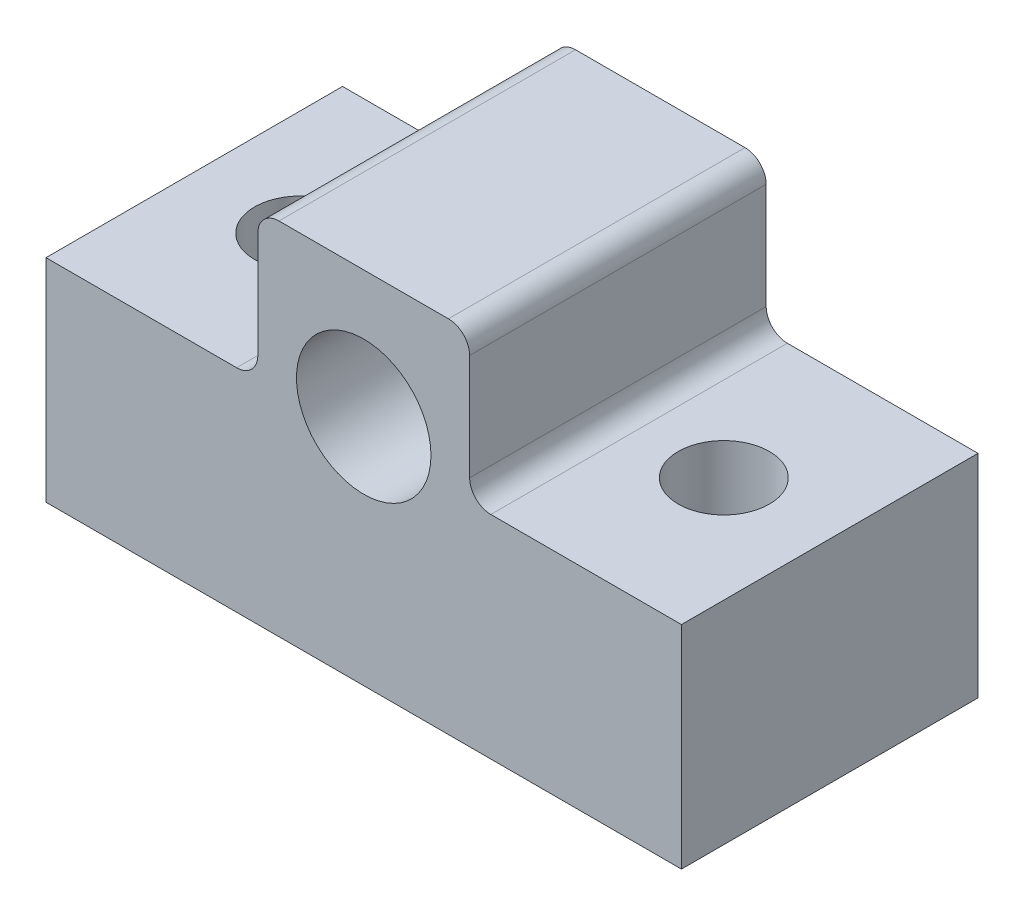
ISO-10303-21;
HEADER;
FILE_DESCRIPTION(('STEP AP214'),'2;1');
FILE_NAME('part.step','',(''),(''),'','','');
FILE_SCHEMA(('AUTOMOTIVE_DESIGN { 1 0 10303 214 1 1 1 1 }'));
ENDSEC;
DATA;
#1=APPLICATION_CONTEXT('core data for automotive mechanical design processes');
#2=APPLICATION_PROTOCOL_DEFINITION('international standard','automotive_design',2000,#1);
#3=PRODUCT_CONTEXT('',#1,'mechanical');
#4=PRODUCT('Part','Part','',(#3));
#5=PRODUCT_RELATED_PRODUCT_CATEGORY('part','',(#4));
#6=PRODUCT_DEFINITION_FORMATION('','',#4);
#7=PRODUCT_DEFINITION_CONTEXT('part definition',#1,'design');
#8=PRODUCT_DEFINITION('design','',#6,#7);
#9=PRODUCT_DEFINITION_SHAPE('','',#8);
#10=(LENGTH_UNIT() NAMED_UNIT(*) SI_UNIT(.MILLI.,.METRE.));
#11=(NAMED_UNIT(*) PLANE_ANGLE_UNIT() SI_UNIT($,.RADIAN.));
#12=(NAMED_UNIT(*) SI_UNIT($,.STERADIAN.) SOLID_ANGLE_UNIT());
#13=UNCERTAINTY_MEASURE_WITH_UNIT(LENGTH_MEASURE(1.E-05),#10,'distance_accuracy_value','');
#14=(GEOMETRIC_REPRESENTATION_CONTEXT(3) GLOBAL_UNCERTAINTY_ASSIGNED_CONTEXT((#13)) GLOBAL_UNIT_ASSIGNED_CONTEXT((#10,
#11,#12)) REPRESENTATION_CONTEXT('',''));
#15=CARTESIAN_POINT('',(0.,0.,0.));
#16=DIRECTION('',(0.,0.,1.));
#17=DIRECTION('',(1.,0.,0.));
#18=AXIS2_PLACEMENT_3D('',#15,#16,#17);
#19=CARTESIAN_POINT('',(-15.,-26.,6.99999999999993));
#20=DIRECTION('',(1.,0.,0.));
#21=DIRECTION('',(0.,0.,-1.));
#22=AXIS2_PLACEMENT_3D('',#19,#20,#21);
#23=PLANE('',#22);
#24=DIRECTION('',(0.,0.,1.));
#25=VECTOR('',#24,1.);
#26=CARTESIAN_POINT('',(-15.,-16.,-7.00000000000005));
#27=LINE('',#26,#25);
#28=CARTESIAN_POINT('',(-15.,-16.,-7.00000000000005));
#29=VERTEX_POINT('',#28);
#30=CARTESIAN_POINT('',(-15.,-16.,6.99999999999995));
#31=VERTEX_POINT('',#30);
#32=EDGE_CURVE('E173',#29,#31,#27,.T.);
#33=ORIENTED_EDGE('',*,*,#32,.F.);
#34=DIRECTION('',(0.,-1.,0.));
#35=VECTOR('',#34,1.);
#36=CARTESIAN_POINT('',(-15.,-26.,-7.00000000000007));
#37=LINE('',#36,#35);
#38=CARTESIAN_POINT('',(-15.,-26.,-7.00000000000007));
#39=VERTEX_POINT('',#38);
#40=EDGE_CURVE('E153',#29,#39,#37,.T.);
#41=ORIENTED_EDGE('',*,*,#40,.T.);
#42=DIRECTION('',(0.,0.,-1.));
#43=VECTOR('',#42,1.);
#44=CARTESIAN_POINT('',(-15.,-26.,6.99999999999993));
#45=LINE('',#44,#43);
#46=CARTESIAN_POINT('',(-15.,-26.,6.99999999999993));
#47=VERTEX_POINT('',#46);
#48=EDGE_CURVE('E161',#47,#39,#45,.T.);
#49=ORIENTED_EDGE('',*,*,#48,.F.);
#50=DIRECTION('',(0.,-1.,0.));
#51=VECTOR('',#50,1.);
#52=CARTESIAN_POINT('',(-15.,-26.,6.99999999999993));
#53=LINE('',#52,#51);
#54=EDGE_CURVE('E148',#31,#47,#53,.T.);
#55=ORIENTED_EDGE('',*,*,#54,.F.);
#56=EDGE_LOOP('',(#33,#41,#49,#55));
#57=FACE_BOUND('',#56,.T.);
#58=ADVANCED_FACE('F32',(#57),#23,.F.);
#59=CARTESIAN_POINT('',(-9.99999999999999,-9.00000000000001,0.));
#60=DIRECTION('',(0.,1.,0.));
#61=DIRECTION('',(0.,0.,1.));
#62=AXIS2_PLACEMENT_3D('',#59,#60,#61);
#63=CYLINDRICAL_SURFACE('',#62,2.15264999999999);
#64=CARTESIAN_POINT('',(-9.99999999999999,-26.,0.));
#65=DIRECTION('',(0.,1.,0.));
#66=DIRECTION('',(0.,0.,1.));
#67=AXIS2_PLACEMENT_3D('',#64,#65,#66);
#68=CIRCLE('',#67,2.15264999999999);
#69=CARTESIAN_POINT('',(-9.99999999999999,-26.,2.15264999999992));
#70=VERTEX_POINT('',#69);
#71=EDGE_CURVE('E257',#70,#70,#68,.T.);
#72=ORIENTED_EDGE('',*,*,#71,.F.);
#73=EDGE_LOOP('',(#72));
#74=FACE_BOUND('',#73,.T.);
#75=CARTESIAN_POINT('',(-9.99999999999999,-16.,0.));
#76=DIRECTION('',(0.,1.,0.));
#77=DIRECTION('',(0.,0.,1.));
#78=AXIS2_PLACEMENT_3D('',#75,#76,#77);
#79=CIRCLE('',#78,2.15264999999999);
#80=CARTESIAN_POINT('',(-9.99999999999999,-16.,2.15264999999992));
#81=VERTEX_POINT('',#80);
#82=EDGE_CURVE('E165',#81,#81,#79,.F.);
#83=ORIENTED_EDGE('',*,*,#82,.F.);
#84=EDGE_LOOP('',(#83));
#85=FACE_BOUND('',#84,.T.);
#86=ADVANCED_FACE('F227',(#74,#85),#63,.F.);
#87=CARTESIAN_POINT('',(15.,-26.,6.99999999999993));
#88=DIRECTION('',(0.,1.,0.));
#89=DIRECTION('',(0.,0.,1.));
#90=AXIS2_PLACEMENT_3D('',#87,#88,#89);
#91=PLANE('',#90);
#92=CARTESIAN_POINT('',(9.99999999999999,-26.,0.));
#93=DIRECTION('',(0.,1.,0.));
#94=DIRECTION('',(0.,0.,1.));
#95=AXIS2_PLACEMENT_3D('',#92,#93,#94);
#96=CIRCLE('',#95,2.15264999999999);
#97=CARTESIAN_POINT('',(9.99999999999999,-26.,2.15264999999992));
#98=VERTEX_POINT('',#97);
#99=EDGE_CURVE('E168',#98,#98,#96,.T.);
#100=ORIENTED_EDGE('',*,*,#99,.T.);
#101=EDGE_LOOP('',(#100));
#102=FACE_BOUND('',#101,.T.);
#103=ORIENTED_EDGE('',*,*,#71,.T.);
#104=EDGE_LOOP('',(#103));
#105=FACE_BOUND('',#104,.T.);
#106=DIRECTION('',(1.,0.,0.));
#107=VECTOR('',#106,1.);
#108=CARTESIAN_POINT('',(15.,-26.,-7.00000000000007));
#109=LINE('',#108,#107);
#110=CARTESIAN_POINT('',(15.,-26.,-7.00000000000007));
#111=VERTEX_POINT('',#110);
#112=EDGE_CURVE('E149',#39,#111,#109,.T.);
#113=ORIENTED_EDGE('',*,*,#112,.T.);
#114=DIRECTION('',(0.,0.,-1.));
#115=VECTOR('',#114,1.);
#116=CARTESIAN_POINT('',(15.,-26.,6.99999999999993));
#117=LINE('',#116,#115);
#118=CARTESIAN_POINT('',(15.,-26.,6.99999999999993));
#119=VERTEX_POINT('',#118);
#120=EDGE_CURVE('E147',#119,#111,#117,.T.);
#121=ORIENTED_EDGE('',*,*,#120,.F.);
#122=DIRECTION('',(1.,0.,0.));
#123=VECTOR('',#122,1.);
#124=CARTESIAN_POINT('',(15.,-26.,6.99999999999993));
#125=LINE('',#124,#123);
#126=EDGE_CURVE('E151',#47,#119,#125,.T.);
#127=ORIENTED_EDGE('',*,*,#126,.F.);
#128=ORIENTED_EDGE('',*,*,#48,.T.);
#129=EDGE_LOOP('',(#113,#121,#127,#128));
#130=FACE_BOUND('',#129,.T.);
#131=ADVANCED_FACE('F232',(#102,#105,#130),#91,.F.);
#132=CARTESIAN_POINT('',(15.,-26.,6.99999999999993));
#133=DIRECTION('',(-1.,0.,0.));
#134=DIRECTION('',(0.,0.,1.));
#135=AXIS2_PLACEMENT_3D('',#132,#133,#134);
#136=PLANE('',#135);
#137=DIRECTION('',(0.,1.,0.));
#138=VECTOR('',#137,1.);
#139=CARTESIAN_POINT('',(15.,-26.,-7.00000000000007));
#140=LINE('',#139,#138);
#141=CARTESIAN_POINT('',(15.,-16.,-7.00000000000005));
#142=VERTEX_POINT('',#141);
#143=EDGE_CURVE('E139',#111,#142,#140,.T.);
#144=ORIENTED_EDGE('',*,*,#143,.T.);
#145=DIRECTION('',(0.,0.,-1.));
#146=VECTOR('',#145,1.);
#147=CARTESIAN_POINT('',(15.,-16.,-7.00000000000005));
#148=LINE('',#147,#146);
#149=CARTESIAN_POINT('',(15.,-16.,6.99999999999995));
#150=VERTEX_POINT('',#149);
#151=EDGE_CURVE('E120',#150,#142,#148,.T.);
#152=ORIENTED_EDGE('',*,*,#151,.F.);
#153=DIRECTION('',(0.,1.,0.));
#154=VECTOR('',#153,1.);
#155=CARTESIAN_POINT('',(15.,-26.,6.99999999999993));
#156=LINE('',#155,#154);
#157=EDGE_CURVE('E158',#119,#150,#156,.T.);
#158=ORIENTED_EDGE('',*,*,#157,.F.);
#159=ORIENTED_EDGE('',*,*,#120,.T.);
#160=EDGE_LOOP('',(#144,#152,#158,#159));
#161=FACE_BOUND('',#160,.T.);
#162=ADVANCED_FACE('F145',(#161),#136,.F.);
#163=CARTESIAN_POINT('',(-15.,26.,7.00000000000007));
#164=DIRECTION('',(0.,0.,-1.));
#165=DIRECTION('',(-1.,0.,0.));
#166=AXIS2_PLACEMENT_3D('',#163,#164,#165);
#167=PLANE('',#166);
#168=CARTESIAN_POINT('',(0.,-15.,6.99999999999995));
#169=DIRECTION('',(0.,0.,1.));
#170=DIRECTION('',(1.,0.,0.));
#171=AXIS2_PLACEMENT_3D('',#168,#169,#170);
#172=CIRCLE('',#171,3.175);
#173=CARTESIAN_POINT('',(3.175,-15.,6.99999999999995));
#174=VERTEX_POINT('',#173);
#175=EDGE_CURVE('E254',#174,#174,#172,.T.);
#176=ORIENTED_EDGE('',*,*,#175,.F.);
#177=EDGE_LOOP('',(#176));
#178=FACE_BOUND('',#177,.T.);
#179=DIRECTION('',(0.,1.,0.));
#180=VECTOR('',#179,1.);
#181=CARTESIAN_POINT('',(5.,-16.,6.99999999999995));
#182=LINE('',#181,#180);
#183=CARTESIAN_POINT('',(5.,-15.,6.99999999999995));
#184=VERTEX_POINT('',#183);
#185=CARTESIAN_POINT('',(5.,-9.99999999999998,7.));
#186=VERTEX_POINT('',#185);
#187=EDGE_CURVE('E174',#184,#186,#182,.T.);
#188=ORIENTED_EDGE('',*,*,#187,.T.);
#189=CARTESIAN_POINT('',(4.,-9.99999999999998,7.));
#190=DIRECTION('',(0.,0.,-1.));
#191=DIRECTION('',(-1.,0.,0.));
#192=AXIS2_PLACEMENT_3D('',#189,#190,#191);
#193=CIRCLE('',#192,1.);
#194=CARTESIAN_POINT('',(3.99999999999999,-8.99999999999998,7.));
#195=VERTEX_POINT('',#194);
#196=EDGE_CURVE('E183',#186,#195,#193,.F.);
#197=ORIENTED_EDGE('',*,*,#196,.T.);
#198=DIRECTION('',(1.,0.,0.));
#199=VECTOR('',#198,1.);
#200=CARTESIAN_POINT('',(-15.,-8.99999999999998,7.));
#201=LINE('',#200,#199);
#202=CARTESIAN_POINT('',(-4.,-8.99999999999998,7.));
#203=VERTEX_POINT('',#202);
#204=EDGE_CURVE('E246',#203,#195,#201,.T.);
#205=ORIENTED_EDGE('',*,*,#204,.F.);
#206=CARTESIAN_POINT('',(-4.,-9.99999999999998,7.));
#207=DIRECTION('',(0.,0.,-1.));
#208=DIRECTION('',(-1.,0.,0.));
#209=AXIS2_PLACEMENT_3D('',#206,#207,#208);
#210=CIRCLE('',#209,1.);
#211=CARTESIAN_POINT('',(-5.,-9.99999999999998,7.));
#212=VERTEX_POINT('',#211);
#213=EDGE_CURVE('E181',#203,#212,#210,.F.);
#214=ORIENTED_EDGE('',*,*,#213,.T.);
#215=DIRECTION('',(0.,1.,0.));
#216=VECTOR('',#215,1.);
#217=CARTESIAN_POINT('',(-5.,-16.,6.99999999999995));
#218=LINE('',#217,#216);
#219=CARTESIAN_POINT('',(-5.,-15.,6.99999999999995));
#220=VERTEX_POINT('',#219);
#221=EDGE_CURVE('E262',#220,#212,#218,.T.);
#222=ORIENTED_EDGE('',*,*,#221,.F.);
#223=CARTESIAN_POINT('',(-6.00000000000001,-15.,6.99999999999995));
#224=DIRECTION('',(0.,0.,-1.));
#225=DIRECTION('',(-1.,0.,0.));
#226=AXIS2_PLACEMENT_3D('',#223,#224,#225);
#227=CIRCLE('',#226,1.);
#228=CARTESIAN_POINT('',(-6.00000000000001,-16.,6.99999999999995));
#229=VERTEX_POINT('',#228);
#230=EDGE_CURVE('E11',#220,#229,#227,.T.);
#231=ORIENTED_EDGE('',*,*,#230,.T.);
#232=DIRECTION('',(1.,0.,0.));
#233=VECTOR('',#232,1.);
#234=CARTESIAN_POINT('',(-15.,-16.,6.99999999999995));
#235=LINE('',#234,#233);
#236=EDGE_CURVE('E242',#31,#229,#235,.T.);
#237=ORIENTED_EDGE('',*,*,#236,.F.);
#238=ORIENTED_EDGE('',*,*,#54,.T.);
#239=ORIENTED_EDGE('',*,*,#126,.T.);
#240=ORIENTED_EDGE('',*,*,#157,.T.);
#241=DIRECTION('',(1.,0.,0.));
#242=VECTOR('',#241,1.);
#243=CARTESIAN_POINT('',(15.,-16.,6.99999999999995));
#244=LINE('',#243,#242);
#245=CARTESIAN_POINT('',(6.00000000000001,-16.,6.99999999999995));
#246=VERTEX_POINT('',#245);
#247=EDGE_CURVE('E128',#246,#150,#244,.T.);
#248=ORIENTED_EDGE('',*,*,#247,.F.);
#249=CARTESIAN_POINT('',(6.00000000000001,-15.,6.99999999999995));
#250=DIRECTION('',(0.,0.,-1.));
#251=DIRECTION('',(-1.,0.,0.));
#252=AXIS2_PLACEMENT_3D('',#249,#250,#251);
#253=CIRCLE('',#252,1.);
#254=EDGE_CURVE('E199',#246,#184,#253,.T.);
#255=ORIENTED_EDGE('',*,*,#254,.T.);
#256=EDGE_LOOP('',(#188,#197,#205,#214,#222,#231,#237,#238,#239,#240,#248,#255));
#257=FACE_BOUND('',#256,.T.);
#258=ADVANCED_FACE('F204',(#178,#257),#167,.F.);
#259=CARTESIAN_POINT('',(-15.,25.9999999999999,-6.99999999999993));
#260=DIRECTION('',(0.,0.,-1.));
#261=DIRECTION('',(-1.,0.,0.));
#262=AXIS2_PLACEMENT_3D('',#259,#260,#261);
#263=PLANE('',#262);
#264=DIRECTION('',(1.,0.,0.));
#265=VECTOR('',#264,1.);
#266=CARTESIAN_POINT('',(-15.,-9.00000000000001,-7.));
#267=LINE('',#266,#265);
#268=CARTESIAN_POINT('',(-4.,-9.00000000000001,-7.));
#269=VERTEX_POINT('',#268);
#270=CARTESIAN_POINT('',(3.99999999999999,-9.00000000000001,-7.));
#271=VERTEX_POINT('',#270);
#272=EDGE_CURVE('E245',#269,#271,#267,.T.);
#273=ORIENTED_EDGE('',*,*,#272,.T.);
#274=CARTESIAN_POINT('',(4.,-10.,-7.));
#275=DIRECTION('',(0.,0.,-1.));
#276=DIRECTION('',(-1.,0.,0.));
#277=AXIS2_PLACEMENT_3D('',#274,#275,#276);
#278=CIRCLE('',#277,1.);
#279=CARTESIAN_POINT('',(5.,-10.,-7.00000000000001));
#280=VERTEX_POINT('',#279);
#281=EDGE_CURVE('E190',#271,#280,#278,.T.);
#282=ORIENTED_EDGE('',*,*,#281,.T.);
#283=DIRECTION('',(0.,1.,0.));
#284=VECTOR('',#283,1.);
#285=CARTESIAN_POINT('',(5.,-16.,-7.00000000000005));
#286=LINE('',#285,#284);
#287=CARTESIAN_POINT('',(5.,-15.,-7.00000000000005));
#288=VERTEX_POINT('',#287);
#289=EDGE_CURVE('E211',#288,#280,#286,.T.);
#290=ORIENTED_EDGE('',*,*,#289,.F.);
#291=CARTESIAN_POINT('',(6.00000000000001,-15.,-7.00000000000005));
#292=DIRECTION('',(0.,0.,-1.));
#293=DIRECTION('',(-1.,0.,0.));
#294=AXIS2_PLACEMENT_3D('',#291,#292,#293);
#295=CIRCLE('',#294,1.);
#296=CARTESIAN_POINT('',(6.00000000000001,-16.,-7.00000000000005));
#297=VERTEX_POINT('',#296);
#298=EDGE_CURVE('E142',#288,#297,#295,.F.);
#299=ORIENTED_EDGE('',*,*,#298,.T.);
#300=DIRECTION('',(-1.,0.,0.));
#301=VECTOR('',#300,1.);
#302=CARTESIAN_POINT('',(15.,-16.,-7.00000000000005));
#303=LINE('',#302,#301);
#304=EDGE_CURVE('E125',#142,#297,#303,.T.);
#305=ORIENTED_EDGE('',*,*,#304,.F.);
#306=ORIENTED_EDGE('',*,*,#143,.F.);
#307=ORIENTED_EDGE('',*,*,#112,.F.);
#308=ORIENTED_EDGE('',*,*,#40,.F.);
#309=DIRECTION('',(-1.,0.,0.));
#310=VECTOR('',#309,1.);
#311=CARTESIAN_POINT('',(-15.,-16.,-7.00000000000005));
#312=LINE('',#311,#310);
#313=CARTESIAN_POINT('',(-6.00000000000001,-16.,-7.00000000000005));
#314=VERTEX_POINT('',#313);
#315=EDGE_CURVE('E244',#314,#29,#312,.T.);
#316=ORIENTED_EDGE('',*,*,#315,.F.);
#317=CARTESIAN_POINT('',(-6.00000000000001,-15.,-7.00000000000005));
#318=DIRECTION('',(0.,0.,-1.));
#319=DIRECTION('',(-1.,0.,0.));
#320=AXIS2_PLACEMENT_3D('',#317,#318,#319);
#321=CIRCLE('',#320,1.);
#322=CARTESIAN_POINT('',(-5.,-15.,-7.00000000000005));
#323=VERTEX_POINT('',#322);
#324=EDGE_CURVE('E39',#314,#323,#321,.F.);
#325=ORIENTED_EDGE('',*,*,#324,.T.);
#326=DIRECTION('',(0.,1.,0.));
#327=VECTOR('',#326,1.);
#328=CARTESIAN_POINT('',(-5.,-16.,-7.00000000000005));
#329=LINE('',#328,#327);
#330=CARTESIAN_POINT('',(-5.,-10.,-7.00000000000001));
#331=VERTEX_POINT('',#330);
#332=EDGE_CURVE('E169',#323,#331,#329,.T.);
#333=ORIENTED_EDGE('',*,*,#332,.T.);
#334=CARTESIAN_POINT('',(-4.,-10.,-7.));
#335=DIRECTION('',(0.,0.,-1.));
#336=DIRECTION('',(-1.,0.,0.));
#337=AXIS2_PLACEMENT_3D('',#334,#335,#336);
#338=CIRCLE('',#337,1.);
#339=EDGE_CURVE('E46',#331,#269,#338,.T.);
#340=ORIENTED_EDGE('',*,*,#339,.T.);
#341=EDGE_LOOP('',(#273,#282,#290,#299,#305,#306,#307,#308,#316,#325,#333,#340));
#342=FACE_BOUND('',#341,.T.);
#343=CARTESIAN_POINT('',(0.,-15.,-7.00000000000005));
#344=DIRECTION('',(0.,0.,1.));
#345=DIRECTION('',(1.,0.,0.));
#346=AXIS2_PLACEMENT_3D('',#343,#344,#345);
#347=CIRCLE('',#346,3.175);
#348=CARTESIAN_POINT('',(3.175,-15.,-7.00000000000005));
#349=VERTEX_POINT('',#348);
#350=EDGE_CURVE('E251',#349,#349,#347,.T.);
#351=ORIENTED_EDGE('',*,*,#350,.T.);
#352=EDGE_LOOP('',(#351));
#353=FACE_BOUND('',#352,.T.);
#354=ADVANCED_FACE('F136',(#342,#353),#263,.T.);
#355=CARTESIAN_POINT('',(-15.,-9.00000000000001,-7.));
#356=DIRECTION('',(0.,-1.,0.));
#357=DIRECTION('',(0.,0.,-1.));
#358=AXIS2_PLACEMENT_3D('',#355,#356,#357);
#359=PLANE('',#358);
#360=ORIENTED_EDGE('',*,*,#204,.T.);
#361=DIRECTION('',(0.,0.,1.));
#362=VECTOR('',#361,1.);
#363=CARTESIAN_POINT('',(4.,-9.00000000000001,-7.));
#364=LINE('',#363,#362);
#365=EDGE_CURVE('E187',#195,#271,#364,.F.);
#366=ORIENTED_EDGE('',*,*,#365,.T.);
#367=ORIENTED_EDGE('',*,*,#272,.F.);
#368=DIRECTION('',(0.,0.,-1.));
#369=VECTOR('',#368,1.);
#370=CARTESIAN_POINT('',(-4.,-9.00000000000001,-7.));
#371=LINE('',#370,#369);
#372=EDGE_CURVE('E185',#269,#203,#371,.F.);
#373=ORIENTED_EDGE('',*,*,#372,.T.);
#374=EDGE_LOOP('',(#360,#366,#367,#373));
#375=FACE_BOUND('',#374,.T.);
#376=ADVANCED_FACE('F274',(#375),#359,.F.);
#377=CARTESIAN_POINT('',(0.,-15.,-7.00000000000005));
#378=DIRECTION('',(0.,0.,1.));
#379=DIRECTION('',(1.,0.,0.));
#380=AXIS2_PLACEMENT_3D('',#377,#378,#379);
#381=CYLINDRICAL_SURFACE('',#380,3.175);
#382=ORIENTED_EDGE('',*,*,#350,.F.);
#383=EDGE_LOOP('',(#382));
#384=FACE_BOUND('',#383,.T.);
#385=ORIENTED_EDGE('',*,*,#175,.T.);
#386=EDGE_LOOP('',(#385));
#387=FACE_BOUND('',#386,.T.);
#388=ADVANCED_FACE('F296',(#384,#387),#381,.F.);
#389=CARTESIAN_POINT('',(9.99999999999999,-9.00000000000001,0.));
#390=DIRECTION('',(0.,1.,0.));
#391=DIRECTION('',(0.,0.,1.));
#392=AXIS2_PLACEMENT_3D('',#389,#390,#391);
#393=CYLINDRICAL_SURFACE('',#392,2.15264999999999);
#394=CARTESIAN_POINT('',(9.99999999999999,-16.,0.));
#395=DIRECTION('',(0.,-1.,0.));
#396=DIRECTION('',(0.,0.,-1.));
#397=AXIS2_PLACEMENT_3D('',#394,#395,#396);
#398=CIRCLE('',#397,2.15264999999999);
#399=CARTESIAN_POINT('',(9.99999999999999,-16.,-2.15265000000006));
#400=VERTEX_POINT('',#399);
#401=EDGE_CURVE('E170',#400,#400,#398,.F.);
#402=ORIENTED_EDGE('',*,*,#401,.T.);
#403=EDGE_LOOP('',(#402));
#404=FACE_BOUND('',#403,.T.);
#405=ORIENTED_EDGE('',*,*,#99,.F.);
#406=EDGE_LOOP('',(#405));
#407=FACE_BOUND('',#406,.T.);
#408=ADVANCED_FACE('F287',(#404,#407),#393,.F.);
#409=CARTESIAN_POINT('',(-15.,-16.,6.99999999999995));
#410=DIRECTION('',(0.,1.,0.));
#411=DIRECTION('',(0.,0.,1.));
#412=AXIS2_PLACEMENT_3D('',#409,#410,#411);
#413=PLANE('',#412);
#414=ORIENTED_EDGE('',*,*,#236,.T.);
#415=DIRECTION('',(0.,0.,-1.));
#416=VECTOR('',#415,1.);
#417=CARTESIAN_POINT('',(-6.00000000000001,-16.,6.99999999999995));
#418=LINE('',#417,#416);
#419=EDGE_CURVE('E196',#229,#314,#418,.T.);
#420=ORIENTED_EDGE('',*,*,#419,.T.);
#421=ORIENTED_EDGE('',*,*,#315,.T.);
#422=ORIENTED_EDGE('',*,*,#32,.T.);
#423=EDGE_LOOP('',(#414,#420,#421,#422));
#424=FACE_BOUND('',#423,.T.);
#425=ORIENTED_EDGE('',*,*,#82,.T.);
#426=EDGE_LOOP('',(#425));
#427=FACE_BOUND('',#426,.T.);
#428=ADVANCED_FACE('F284',(#424,#427),#413,.T.);
#429=CARTESIAN_POINT('',(-5.,-16.,-7.00000000000005));
#430=DIRECTION('',(1.,0.,0.));
#431=DIRECTION('',(0.,0.,-1.));
#432=AXIS2_PLACEMENT_3D('',#429,#430,#431);
#433=PLANE('',#432);
#434=ORIENTED_EDGE('',*,*,#221,.T.);
#435=DIRECTION('',(0.,0.,-1.));
#436=VECTOR('',#435,1.);
#437=CARTESIAN_POINT('',(-5.,-10.,-7.00000000000001));
#438=LINE('',#437,#436);
#439=EDGE_CURVE('E194',#212,#331,#438,.T.);
#440=ORIENTED_EDGE('',*,*,#439,.T.);
#441=ORIENTED_EDGE('',*,*,#332,.F.);
#442=DIRECTION('',(0.,0.,-1.));
#443=VECTOR('',#442,1.);
#444=CARTESIAN_POINT('',(-5.,-15.,-7.00000000000005));
#445=LINE('',#444,#443);
#446=EDGE_CURVE('E192',#323,#220,#445,.F.);
#447=ORIENTED_EDGE('',*,*,#446,.T.);
#448=EDGE_LOOP('',(#434,#440,#441,#447));
#449=FACE_BOUND('',#448,.T.);
#450=ADVANCED_FACE('F279',(#449),#433,.F.);
#451=CARTESIAN_POINT('',(15.,-16.,6.99999999999995));
#452=DIRECTION('',(0.,-1.,0.));
#453=DIRECTION('',(0.,0.,-1.));
#454=AXIS2_PLACEMENT_3D('',#451,#452,#453);
#455=PLANE('',#454);
#456=ORIENTED_EDGE('',*,*,#304,.T.);
#457=DIRECTION('',(0.,0.,1.));
#458=VECTOR('',#457,1.);
#459=CARTESIAN_POINT('',(6.00000000000001,-16.,6.99999999999995));
#460=LINE('',#459,#458);
#461=EDGE_CURVE('E164',#297,#246,#460,.T.);
#462=ORIENTED_EDGE('',*,*,#461,.T.);
#463=ORIENTED_EDGE('',*,*,#247,.T.);
#464=ORIENTED_EDGE('',*,*,#151,.T.);
#465=EDGE_LOOP('',(#456,#462,#463,#464));
#466=FACE_BOUND('',#465,.T.);
#467=ORIENTED_EDGE('',*,*,#401,.F.);
#468=EDGE_LOOP('',(#467));
#469=FACE_BOUND('',#468,.T.);
#470=ADVANCED_FACE('F122',(#466,#469),#455,.F.);
#471=CARTESIAN_POINT('',(5.,-16.,-7.00000000000005));
#472=DIRECTION('',(-1.,0.,0.));
#473=DIRECTION('',(0.,0.,1.));
#474=AXIS2_PLACEMENT_3D('',#471,#472,#473);
#475=PLANE('',#474);
#476=ORIENTED_EDGE('',*,*,#187,.F.);
#477=DIRECTION('',(0.,0.,1.));
#478=VECTOR('',#477,1.);
#479=CARTESIAN_POINT('',(5.,-15.,-7.00000000000005));
#480=LINE('',#479,#478);
#481=EDGE_CURVE('E179',#184,#288,#480,.F.);
#482=ORIENTED_EDGE('',*,*,#481,.T.);
#483=ORIENTED_EDGE('',*,*,#289,.T.);
#484=DIRECTION('',(0.,0.,1.));
#485=VECTOR('',#484,1.);
#486=CARTESIAN_POINT('',(5.,-10.,-7.00000000000001));
#487=LINE('',#486,#485);
#488=EDGE_CURVE('E176',#280,#186,#487,.T.);
#489=ORIENTED_EDGE('',*,*,#488,.T.);
#490=EDGE_LOOP('',(#476,#482,#483,#489));
#491=FACE_BOUND('',#490,.T.);
#492=ADVANCED_FACE('F208',(#491),#475,.F.);
#493=CARTESIAN_POINT('',(6.00000000000001,-15.,6.99999999999995));
#494=DIRECTION('',(0.,0.,-1.));
#495=DIRECTION('',(-1.,0.,0.));
#496=AXIS2_PLACEMENT_3D('',#493,#494,#495);
#497=CYLINDRICAL_SURFACE('',#496,1.);
#498=ORIENTED_EDGE('',*,*,#298,.F.);
#499=ORIENTED_EDGE('',*,*,#481,.F.);
#500=ORIENTED_EDGE('',*,*,#254,.F.);
#501=ORIENTED_EDGE('',*,*,#461,.F.);
#502=EDGE_LOOP('',(#498,#499,#500,#501));
#503=FACE_BOUND('',#502,.T.);
#504=ADVANCED_FACE('F213',(#503),#497,.F.);
#505=CARTESIAN_POINT('',(4.,-10.,-7.00000000000001));
#506=DIRECTION('',(0.,0.,1.));
#507=DIRECTION('',(1.,0.,0.));
#508=AXIS2_PLACEMENT_3D('',#505,#506,#507);
#509=CYLINDRICAL_SURFACE('',#508,1.);
#510=ORIENTED_EDGE('',*,*,#281,.F.);
#511=ORIENTED_EDGE('',*,*,#365,.F.);
#512=ORIENTED_EDGE('',*,*,#196,.F.);
#513=ORIENTED_EDGE('',*,*,#488,.F.);
#514=EDGE_LOOP('',(#510,#511,#512,#513));
#515=FACE_BOUND('',#514,.T.);
#516=ADVANCED_FACE('F215',(#515),#509,.T.);
#517=CARTESIAN_POINT('',(-4.,-10.,-7.00000000000001));
#518=DIRECTION('',(0.,0.,-1.));
#519=DIRECTION('',(-1.,0.,0.));
#520=AXIS2_PLACEMENT_3D('',#517,#518,#519);
#521=CYLINDRICAL_SURFACE('',#520,1.);
#522=ORIENTED_EDGE('',*,*,#213,.F.);
#523=ORIENTED_EDGE('',*,*,#372,.F.);
#524=ORIENTED_EDGE('',*,*,#339,.F.);
#525=ORIENTED_EDGE('',*,*,#439,.F.);
#526=EDGE_LOOP('',(#522,#523,#524,#525));
#527=FACE_BOUND('',#526,.T.);
#528=ADVANCED_FACE('F221',(#527),#521,.T.);
#529=CARTESIAN_POINT('',(-6.00000000000001,-15.,6.99999999999995));
#530=DIRECTION('',(0.,0.,-1.));
#531=DIRECTION('',(-1.,0.,0.));
#532=AXIS2_PLACEMENT_3D('',#529,#530,#531);
#533=CYLINDRICAL_SURFACE('',#532,1.);
#534=ORIENTED_EDGE('',*,*,#230,.F.);
#535=ORIENTED_EDGE('',*,*,#446,.F.);
#536=ORIENTED_EDGE('',*,*,#324,.F.);
#537=ORIENTED_EDGE('',*,*,#419,.F.);
#538=EDGE_LOOP('',(#534,#535,#536,#537));
#539=FACE_BOUND('',#538,.T.);
#540=ADVANCED_FACE('F282',(#539),#533,.F.);
#541=CLOSED_SHELL('',(#58,#86,#131,#162,#258,#354,#376,#388,#408,#428,#450,#470,#492,#504,#516,
#528,#540));
#542=MANIFOLD_SOLID_BREP('B2',#541);
#543=ADVANCED_BREP_SHAPE_REPRESENTATION('',(#18,#542),#14);
#544=SHAPE_DEFINITION_REPRESENTATION(#9,#543);
ENDSEC;
END-ISO-10303-21;
